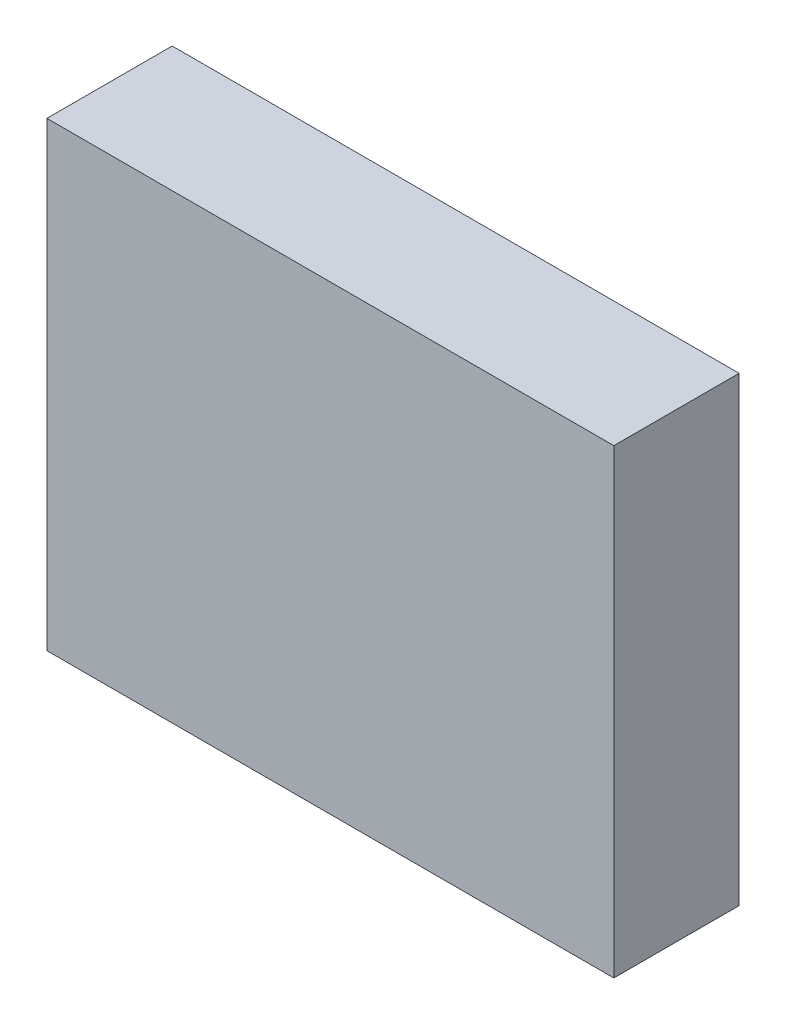
ISO-10303-21;
HEADER;
FILE_DESCRIPTION(('STEP AP214'),'2;1');
FILE_NAME('part.step','',(''),(''),'','','');
FILE_SCHEMA(('AUTOMOTIVE_DESIGN { 1 0 10303 214 1 1 1 1 }'));
ENDSEC;
DATA;
#1=APPLICATION_CONTEXT('core data for automotive mechanical design processes');
#2=APPLICATION_PROTOCOL_DEFINITION('international standard','automotive_design',2000,#1);
#3=PRODUCT_CONTEXT('',#1,'mechanical');
#4=PRODUCT('Part','Part','',(#3));
#5=PRODUCT_RELATED_PRODUCT_CATEGORY('part','',(#4));
#6=PRODUCT_DEFINITION_FORMATION('','',#4);
#7=PRODUCT_DEFINITION_CONTEXT('part definition',#1,'design');
#8=PRODUCT_DEFINITION('design','',#6,#7);
#9=PRODUCT_DEFINITION_SHAPE('','',#8);
#10=(LENGTH_UNIT() NAMED_UNIT(*) SI_UNIT(.MILLI.,.METRE.));
#11=(NAMED_UNIT(*) PLANE_ANGLE_UNIT() SI_UNIT($,.RADIAN.));
#12=(NAMED_UNIT(*) SI_UNIT($,.STERADIAN.) SOLID_ANGLE_UNIT());
#13=UNCERTAINTY_MEASURE_WITH_UNIT(LENGTH_MEASURE(1.E-05),#10,'distance_accuracy_value','');
#14=(GEOMETRIC_REPRESENTATION_CONTEXT(3) GLOBAL_UNCERTAINTY_ASSIGNED_CONTEXT((#13)) GLOBAL_UNIT_ASSIGNED_CONTEXT((#10,
#11,#12)) REPRESENTATION_CONTEXT('',''));
#15=CARTESIAN_POINT('',(0.,0.,0.));
#16=DIRECTION('',(0.,0.,1.));
#17=DIRECTION('',(1.,0.,0.));
#18=AXIS2_PLACEMENT_3D('',#15,#16,#17);
#19=CARTESIAN_POINT('',(-1.454,-0.184,0.));
#20=DIRECTION('',(1.,0.,0.));
#21=DIRECTION('',(0.,0.,1.));
#22=AXIS2_PLACEMENT_3D('',#19,#20,#21);
#23=PLANE('',#22);
#24=DIRECTION('',(0.,1.,0.));
#25=VECTOR('',#24,1.);
#26=CARTESIAN_POINT('',(-1.454,-0.184,0.1));
#27=LINE('',#26,#25);
#28=CARTESIAN_POINT('',(-1.454,-0.184,0.1));
#29=VERTEX_POINT('',#28);
#30=CARTESIAN_POINT('',(-1.454,0.184,0.1));
#31=VERTEX_POINT('',#30);
#32=EDGE_CURVE('E11',#29,#31,#27,.T.);
#33=ORIENTED_EDGE('',*,*,#32,.T.);
#34=DIRECTION('',(0.,0.,1.));
#35=VECTOR('',#34,1.);
#36=CARTESIAN_POINT('',(-1.454,0.184,0.));
#37=LINE('',#36,#35);
#38=CARTESIAN_POINT('',(-1.454,0.184,0.));
#39=VERTEX_POINT('',#38);
#40=EDGE_CURVE('E24',#39,#31,#37,.T.);
#41=ORIENTED_EDGE('',*,*,#40,.F.);
#42=DIRECTION('',(0.,1.,0.));
#43=VECTOR('',#42,1.);
#44=CARTESIAN_POINT('',(-1.454,-0.184,0.));
#45=LINE('',#44,#43);
#46=CARTESIAN_POINT('',(-1.454,-0.184,0.));
#47=VERTEX_POINT('',#46);
#48=EDGE_CURVE('E86',#47,#39,#45,.T.);
#49=ORIENTED_EDGE('',*,*,#48,.F.);
#50=DIRECTION('',(0.,0.,1.));
#51=VECTOR('',#50,1.);
#52=CARTESIAN_POINT('',(-1.454,-0.184,0.));
#53=LINE('',#52,#51);
#54=EDGE_CURVE('E36',#47,#29,#53,.T.);
#55=ORIENTED_EDGE('',*,*,#54,.T.);
#56=EDGE_LOOP('',(#33,#41,#49,#55));
#57=FACE_BOUND('',#56,.T.);
#58=ADVANCED_FACE('F17',(#57),#23,.F.);
#59=CARTESIAN_POINT('',(-1.0015,-0.184,0.));
#60=DIRECTION('',(1.,0.,0.));
#61=DIRECTION('',(0.,0.,1.));
#62=AXIS2_PLACEMENT_3D('',#59,#60,#61);
#63=PLANE('',#62);
#64=DIRECTION('',(0.,0.,1.));
#65=VECTOR('',#64,1.);
#66=CARTESIAN_POINT('',(-1.0015,-0.184,0.));
#67=LINE('',#66,#65);
#68=CARTESIAN_POINT('',(-1.0015,-0.184,0.));
#69=VERTEX_POINT('',#68);
#70=CARTESIAN_POINT('',(-1.0015,-0.184,0.1));
#71=VERTEX_POINT('',#70);
#72=EDGE_CURVE('E83',#69,#71,#67,.T.);
#73=ORIENTED_EDGE('',*,*,#72,.F.);
#74=DIRECTION('',(0.,1.,0.));
#75=VECTOR('',#74,1.);
#76=CARTESIAN_POINT('',(-1.0015,-0.184,0.));
#77=LINE('',#76,#75);
#78=CARTESIAN_POINT('',(-1.0015,0.184,0.));
#79=VERTEX_POINT('',#78);
#80=EDGE_CURVE('E63',#69,#79,#77,.T.);
#81=ORIENTED_EDGE('',*,*,#80,.T.);
#82=DIRECTION('',(0.,0.,1.));
#83=VECTOR('',#82,1.);
#84=CARTESIAN_POINT('',(-1.0015,0.184,0.));
#85=LINE('',#84,#83);
#86=CARTESIAN_POINT('',(-1.0015,0.184,0.1));
#87=VERTEX_POINT('',#86);
#88=EDGE_CURVE('E57',#79,#87,#85,.T.);
#89=ORIENTED_EDGE('',*,*,#88,.T.);
#90=DIRECTION('',(0.,1.,0.));
#91=VECTOR('',#90,1.);
#92=CARTESIAN_POINT('',(-1.0015,-0.184,0.1));
#93=LINE('',#92,#91);
#94=EDGE_CURVE('E60',#71,#87,#93,.T.);
#95=ORIENTED_EDGE('',*,*,#94,.F.);
#96=EDGE_LOOP('',(#73,#81,#89,#95));
#97=FACE_BOUND('',#96,.T.);
#98=ADVANCED_FACE('F59',(#97),#63,.T.);
#99=CARTESIAN_POINT('',(-1.454,-0.184,0.));
#100=DIRECTION('',(0.,1.,0.));
#101=DIRECTION('',(0.,0.,1.));
#102=AXIS2_PLACEMENT_3D('',#99,#100,#101);
#103=PLANE('',#102);
#104=ORIENTED_EDGE('',*,*,#72,.T.);
#105=DIRECTION('',(1.,0.,0.));
#106=VECTOR('',#105,1.);
#107=CARTESIAN_POINT('',(-1.454,-0.184,0.1));
#108=LINE('',#107,#106);
#109=EDGE_CURVE('E71',#29,#71,#108,.T.);
#110=ORIENTED_EDGE('',*,*,#109,.F.);
#111=ORIENTED_EDGE('',*,*,#54,.F.);
#112=DIRECTION('',(1.,0.,0.));
#113=VECTOR('',#112,1.);
#114=CARTESIAN_POINT('',(-1.454,-0.184,0.));
#115=LINE('',#114,#113);
#116=EDGE_CURVE('E76',#47,#69,#115,.T.);
#117=ORIENTED_EDGE('',*,*,#116,.T.);
#118=EDGE_LOOP('',(#104,#110,#111,#117));
#119=FACE_BOUND('',#118,.T.);
#120=ADVANCED_FACE('F91',(#119),#103,.F.);
#121=CARTESIAN_POINT('',(-1.454,0.184,0.));
#122=DIRECTION('',(0.,1.,0.));
#123=DIRECTION('',(0.,0.,1.));
#124=AXIS2_PLACEMENT_3D('',#121,#122,#123);
#125=PLANE('',#124);
#126=DIRECTION('',(1.,0.,0.));
#127=VECTOR('',#126,1.);
#128=CARTESIAN_POINT('',(-1.454,0.184,0.));
#129=LINE('',#128,#127);
#130=EDGE_CURVE('E74',#39,#79,#129,.T.);
#131=ORIENTED_EDGE('',*,*,#130,.F.);
#132=ORIENTED_EDGE('',*,*,#40,.T.);
#133=DIRECTION('',(1.,0.,0.));
#134=VECTOR('',#133,1.);
#135=CARTESIAN_POINT('',(-1.454,0.184,0.1));
#136=LINE('',#135,#134);
#137=EDGE_CURVE('E69',#31,#87,#136,.T.);
#138=ORIENTED_EDGE('',*,*,#137,.T.);
#139=ORIENTED_EDGE('',*,*,#88,.F.);
#140=EDGE_LOOP('',(#131,#132,#138,#139));
#141=FACE_BOUND('',#140,.T.);
#142=ADVANCED_FACE('F73',(#141),#125,.T.);
#143=CARTESIAN_POINT('',(-1.454,-0.184,0.));
#144=DIRECTION('',(0.,0.,1.));
#145=DIRECTION('',(1.,0.,0.));
#146=AXIS2_PLACEMENT_3D('',#143,#144,#145);
#147=PLANE('',#146);
#148=ORIENTED_EDGE('',*,*,#130,.T.);
#149=ORIENTED_EDGE('',*,*,#80,.F.);
#150=ORIENTED_EDGE('',*,*,#116,.F.);
#151=ORIENTED_EDGE('',*,*,#48,.T.);
#152=EDGE_LOOP('',(#148,#149,#150,#151));
#153=FACE_BOUND('',#152,.T.);
#154=ADVANCED_FACE('F89',(#153),#147,.F.);
#155=CARTESIAN_POINT('',(-1.454,-0.184,0.1));
#156=DIRECTION('',(0.,0.,1.));
#157=DIRECTION('',(1.,0.,0.));
#158=AXIS2_PLACEMENT_3D('',#155,#156,#157);
#159=PLANE('',#158);
#160=ORIENTED_EDGE('',*,*,#32,.F.);
#161=ORIENTED_EDGE('',*,*,#109,.T.);
#162=ORIENTED_EDGE('',*,*,#94,.T.);
#163=ORIENTED_EDGE('',*,*,#137,.F.);
#164=EDGE_LOOP('',(#160,#161,#162,#163));
#165=FACE_BOUND('',#164,.T.);
#166=ADVANCED_FACE('F68',(#165),#159,.T.);
#167=CLOSED_SHELL('',(#58,#98,#120,#142,#154,#166));
#168=MANIFOLD_SOLID_BREP('B1',#167);
#169=ADVANCED_BREP_SHAPE_REPRESENTATION('',(#18,#168),#14);
#170=SHAPE_DEFINITION_REPRESENTATION(#9,#169);
ENDSEC;
END-ISO-10303-21;
